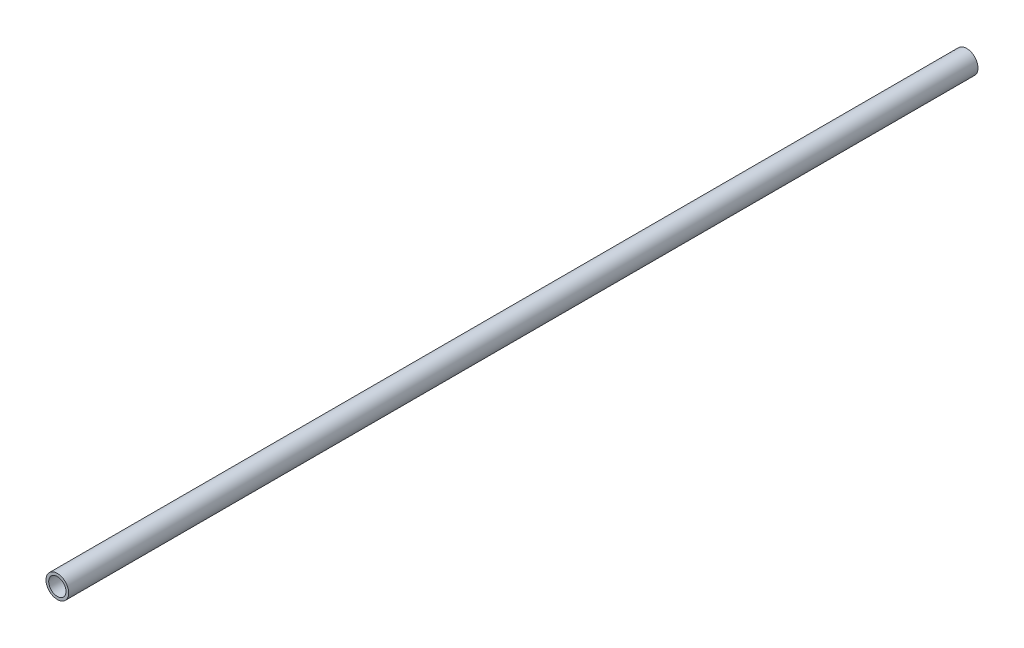
ISO-10303-21;
HEADER;
FILE_DESCRIPTION(('STEP AP214'),'2;1');
FILE_NAME('part.step','',(''),(''),'','','');
FILE_SCHEMA(('AUTOMOTIVE_DESIGN { 1 0 10303 214 1 1 1 1 }'));
ENDSEC;
DATA;
#1=APPLICATION_CONTEXT('core data for automotive mechanical design processes');
#2=APPLICATION_PROTOCOL_DEFINITION('international standard','automotive_design',2000,#1);
#3=PRODUCT_CONTEXT('',#1,'mechanical');
#4=PRODUCT('Part','Part','',(#3));
#5=PRODUCT_RELATED_PRODUCT_CATEGORY('part','',(#4));
#6=PRODUCT_DEFINITION_FORMATION('','',#4);
#7=PRODUCT_DEFINITION_CONTEXT('part definition',#1,'design');
#8=PRODUCT_DEFINITION('design','',#6,#7);
#9=PRODUCT_DEFINITION_SHAPE('','',#8);
#10=(LENGTH_UNIT() NAMED_UNIT(*) SI_UNIT(.MILLI.,.METRE.));
#11=(NAMED_UNIT(*) PLANE_ANGLE_UNIT() SI_UNIT($,.RADIAN.));
#12=(NAMED_UNIT(*) SI_UNIT($,.STERADIAN.) SOLID_ANGLE_UNIT());
#13=UNCERTAINTY_MEASURE_WITH_UNIT(LENGTH_MEASURE(1.E-05),#10,'distance_accuracy_value','');
#14=(GEOMETRIC_REPRESENTATION_CONTEXT(3) GLOBAL_UNCERTAINTY_ASSIGNED_CONTEXT((#13)) GLOBAL_UNIT_ASSIGNED_CONTEXT((#10,
#11,#12)) REPRESENTATION_CONTEXT('',''));
#15=CARTESIAN_POINT('',(0.,0.,0.));
#16=DIRECTION('',(0.,0.,1.));
#17=DIRECTION('',(1.,0.,0.));
#18=AXIS2_PLACEMENT_3D('',#15,#16,#17);
#19=CARTESIAN_POINT('',(0.,0.,1000.));
#20=DIRECTION('',(0.,0.,1.));
#21=DIRECTION('',(1.,0.,0.));
#22=AXIS2_PLACEMENT_3D('',#19,#20,#21);
#23=PLANE('',#22);
#24=CARTESIAN_POINT('',(0.,0.,1000.));
#25=DIRECTION('',(0.,0.,1.));
#26=DIRECTION('',(1.,0.,0.));
#27=AXIS2_PLACEMENT_3D('',#24,#25,#26);
#28=CIRCLE('',#27,12.5);
#29=CARTESIAN_POINT('',(12.5,0.,1000.));
#30=VERTEX_POINT('',#29);
#31=EDGE_CURVE('E10',#30,#30,#28,.T.);
#32=ORIENTED_EDGE('',*,*,#31,.T.);
#33=EDGE_LOOP('',(#32));
#34=FACE_BOUND('',#33,.T.);
#35=CARTESIAN_POINT('',(0.,0.,1000.));
#36=DIRECTION('',(0.,0.,1.));
#37=DIRECTION('',(1.,0.,0.));
#38=AXIS2_PLACEMENT_3D('',#35,#36,#37);
#39=CIRCLE('',#38,9.5);
#40=CARTESIAN_POINT('',(9.5,0.,1000.));
#41=VERTEX_POINT('',#40);
#42=EDGE_CURVE('E48',#41,#41,#39,.T.);
#43=ORIENTED_EDGE('',*,*,#42,.F.);
#44=EDGE_LOOP('',(#43));
#45=FACE_BOUND('',#44,.T.);
#46=ADVANCED_FACE('F37',(#34,#45),#23,.T.);
#47=CARTESIAN_POINT('',(0.,0.,0.));
#48=DIRECTION('',(0.,0.,1.));
#49=DIRECTION('',(1.,0.,0.));
#50=AXIS2_PLACEMENT_3D('',#47,#48,#49);
#51=PLANE('',#50);
#52=CARTESIAN_POINT('',(0.,0.,0.));
#53=DIRECTION('',(0.,0.,1.));
#54=DIRECTION('',(1.,0.,0.));
#55=AXIS2_PLACEMENT_3D('',#52,#53,#54);
#56=CIRCLE('',#55,12.5);
#57=CARTESIAN_POINT('',(12.5,0.,0.));
#58=VERTEX_POINT('',#57);
#59=EDGE_CURVE('E41',#58,#58,#56,.T.);
#60=ORIENTED_EDGE('',*,*,#59,.F.);
#61=EDGE_LOOP('',(#60));
#62=FACE_BOUND('',#61,.T.);
#63=CARTESIAN_POINT('',(0.,0.,0.));
#64=DIRECTION('',(0.,0.,1.));
#65=DIRECTION('',(1.,0.,0.));
#66=AXIS2_PLACEMENT_3D('',#63,#64,#65);
#67=CIRCLE('',#66,9.5);
#68=CARTESIAN_POINT('',(9.5,0.,0.));
#69=VERTEX_POINT('',#68);
#70=EDGE_CURVE('E50',#69,#69,#67,.T.);
#71=ORIENTED_EDGE('',*,*,#70,.T.);
#72=EDGE_LOOP('',(#71));
#73=FACE_BOUND('',#72,.T.);
#74=ADVANCED_FACE('F60',(#62,#73),#51,.F.);
#75=CARTESIAN_POINT('',(0.,0.,1000.));
#76=DIRECTION('',(0.,0.,-1.));
#77=DIRECTION('',(-1.,0.,0.));
#78=AXIS2_PLACEMENT_3D('',#75,#76,#77);
#79=CYLINDRICAL_SURFACE('',#78,12.5);
#80=ORIENTED_EDGE('',*,*,#31,.F.);
#81=EDGE_LOOP('',(#80));
#82=FACE_BOUND('',#81,.T.);
#83=ORIENTED_EDGE('',*,*,#59,.T.);
#84=EDGE_LOOP('',(#83));
#85=FACE_BOUND('',#84,.T.);
#86=ADVANCED_FACE('F39',(#82,#85),#79,.T.);
#87=CARTESIAN_POINT('',(0.,0.,1000.));
#88=DIRECTION('',(0.,0.,-1.));
#89=DIRECTION('',(-1.,0.,0.));
#90=AXIS2_PLACEMENT_3D('',#87,#88,#89);
#91=CYLINDRICAL_SURFACE('',#90,9.5);
#92=ORIENTED_EDGE('',*,*,#42,.T.);
#93=EDGE_LOOP('',(#92));
#94=FACE_BOUND('',#93,.T.);
#95=ORIENTED_EDGE('',*,*,#70,.F.);
#96=EDGE_LOOP('',(#95));
#97=FACE_BOUND('',#96,.T.);
#98=ADVANCED_FACE('F56',(#94,#97),#91,.F.);
#99=CLOSED_SHELL('',(#46,#74,#86,#98));
#100=MANIFOLD_SOLID_BREP('B2',#99);
#101=ADVANCED_BREP_SHAPE_REPRESENTATION('',(#18,#100),#14);
#102=SHAPE_DEFINITION_REPRESENTATION(#9,#101);
ENDSEC;
END-ISO-10303-21;
